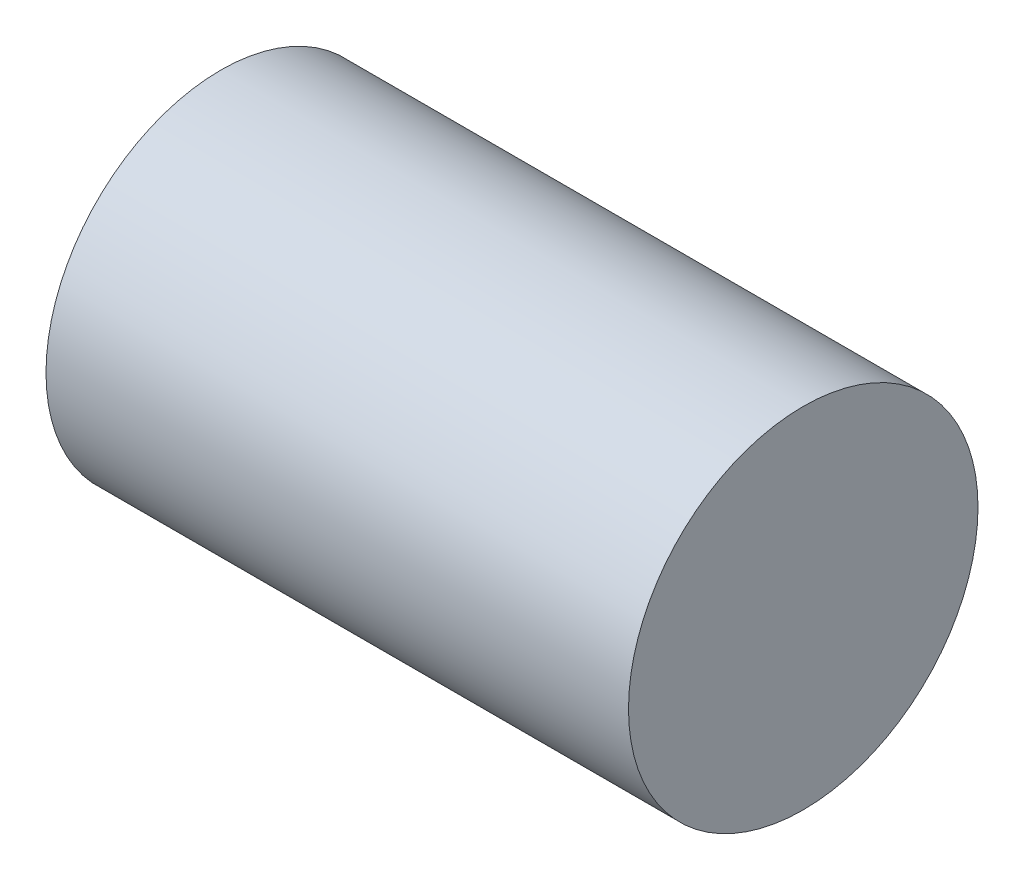
ISO-10303-21;
HEADER;
FILE_DESCRIPTION(('STEP AP214'),'2;1');
FILE_NAME('part.step','',(''),(''),'','','');
FILE_SCHEMA(('AUTOMOTIVE_DESIGN { 1 0 10303 214 1 1 1 1 }'));
ENDSEC;
DATA;
#1=APPLICATION_CONTEXT('core data for automotive mechanical design processes');
#2=APPLICATION_PROTOCOL_DEFINITION('international standard','automotive_design',2000,#1);
#3=PRODUCT_CONTEXT('',#1,'mechanical');
#4=PRODUCT('Part','Part','',(#3));
#5=PRODUCT_RELATED_PRODUCT_CATEGORY('part','',(#4));
#6=PRODUCT_DEFINITION_FORMATION('','',#4);
#7=PRODUCT_DEFINITION_CONTEXT('part definition',#1,'design');
#8=PRODUCT_DEFINITION('design','',#6,#7);
#9=PRODUCT_DEFINITION_SHAPE('','',#8);
#10=(LENGTH_UNIT() NAMED_UNIT(*) SI_UNIT(.MILLI.,.METRE.));
#11=(NAMED_UNIT(*) PLANE_ANGLE_UNIT() SI_UNIT($,.RADIAN.));
#12=(NAMED_UNIT(*) SI_UNIT($,.STERADIAN.) SOLID_ANGLE_UNIT());
#13=UNCERTAINTY_MEASURE_WITH_UNIT(LENGTH_MEASURE(1.E-05),#10,'distance_accuracy_value','');
#14=(GEOMETRIC_REPRESENTATION_CONTEXT(3) GLOBAL_UNCERTAINTY_ASSIGNED_CONTEXT((#13)) GLOBAL_UNIT_ASSIGNED_CONTEXT((#10,
#11,#12)) REPRESENTATION_CONTEXT('',''));
#15=CARTESIAN_POINT('',(0.,0.,0.));
#16=DIRECTION('',(0.,0.,1.));
#17=DIRECTION('',(1.,0.,0.));
#18=AXIS2_PLACEMENT_3D('',#15,#16,#17);
#19=CARTESIAN_POINT('',(12.5,0.,0.));
#20=DIRECTION('',(-1.,0.,0.));
#21=DIRECTION('',(0.,0.,1.));
#22=AXIS2_PLACEMENT_3D('',#19,#20,#21);
#23=CYLINDRICAL_SURFACE('',#22,3.75);
#24=CARTESIAN_POINT('',(12.5,0.,0.));
#25=DIRECTION('',(1.,0.,0.));
#26=DIRECTION('',(0.,0.,-1.));
#27=AXIS2_PLACEMENT_3D('',#24,#25,#26);
#28=CIRCLE('',#27,3.75);
#29=CARTESIAN_POINT('',(12.5,0.,-3.75));
#30=VERTEX_POINT('',#29);
#31=EDGE_CURVE('E10',#30,#30,#28,.T.);
#32=ORIENTED_EDGE('',*,*,#31,.F.);
#33=EDGE_LOOP('',(#32));
#34=FACE_BOUND('',#33,.T.);
#35=CARTESIAN_POINT('',(0.,0.,0.));
#36=DIRECTION('',(1.,0.,0.));
#37=DIRECTION('',(0.,0.,-1.));
#38=AXIS2_PLACEMENT_3D('',#35,#36,#37);
#39=CIRCLE('',#38,3.75);
#40=CARTESIAN_POINT('',(0.,0.,-3.75));
#41=VERTEX_POINT('',#40);
#42=EDGE_CURVE('E34',#41,#41,#39,.T.);
#43=ORIENTED_EDGE('',*,*,#42,.T.);
#44=EDGE_LOOP('',(#43));
#45=FACE_BOUND('',#44,.T.);
#46=ADVANCED_FACE('F31',(#34,#45),#23,.T.);
#47=CARTESIAN_POINT('',(12.5,0.,0.));
#48=DIRECTION('',(1.,0.,0.));
#49=DIRECTION('',(0.,0.,-1.));
#50=AXIS2_PLACEMENT_3D('',#47,#48,#49);
#51=PLANE('',#50);
#52=ORIENTED_EDGE('',*,*,#31,.T.);
#53=EDGE_LOOP('',(#52));
#54=FACE_BOUND('',#53,.T.);
#55=ADVANCED_FACE('F46',(#54),#51,.T.);
#56=CARTESIAN_POINT('',(0.,0.,0.));
#57=DIRECTION('',(1.,0.,0.));
#58=DIRECTION('',(0.,0.,-1.));
#59=AXIS2_PLACEMENT_3D('',#56,#57,#58);
#60=PLANE('',#59);
#61=ORIENTED_EDGE('',*,*,#42,.F.);
#62=EDGE_LOOP('',(#61));
#63=FACE_BOUND('',#62,.T.);
#64=ADVANCED_FACE('F44',(#63),#60,.F.);
#65=CLOSED_SHELL('',(#46,#55,#64));
#66=MANIFOLD_SOLID_BREP('B2',#65);
#67=ADVANCED_BREP_SHAPE_REPRESENTATION('',(#18,#66),#14);
#68=SHAPE_DEFINITION_REPRESENTATION(#9,#67);
ENDSEC;
END-ISO-10303-21;
